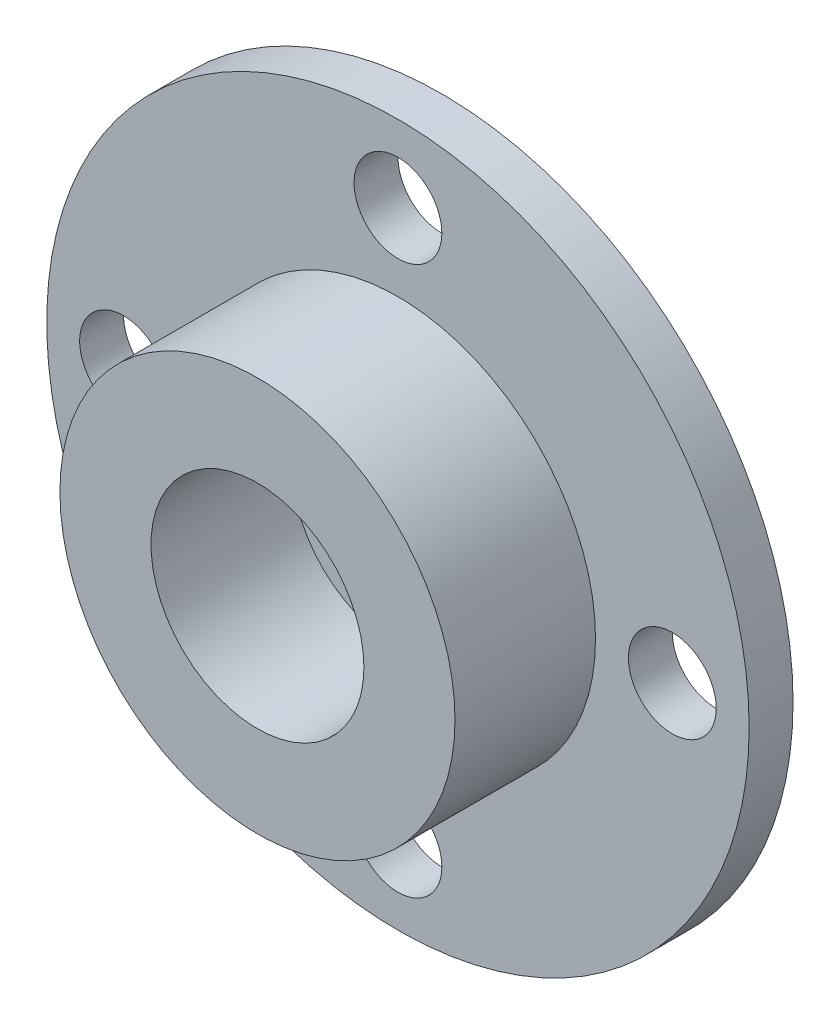
ISO-10303-21;
HEADER;
FILE_DESCRIPTION(('STEP AP214'),'2;1');
FILE_NAME('part.step','',(''),(''),'','','');
FILE_SCHEMA(('AUTOMOTIVE_DESIGN { 1 0 10303 214 1 1 1 1 }'));
ENDSEC;
DATA;
#1=APPLICATION_CONTEXT('core data for automotive mechanical design processes');
#2=APPLICATION_PROTOCOL_DEFINITION('international standard','automotive_design',2000,#1);
#3=PRODUCT_CONTEXT('',#1,'mechanical');
#4=PRODUCT('Part','Part','',(#3));
#5=PRODUCT_RELATED_PRODUCT_CATEGORY('part','',(#4));
#6=PRODUCT_DEFINITION_FORMATION('','',#4);
#7=PRODUCT_DEFINITION_CONTEXT('part definition',#1,'design');
#8=PRODUCT_DEFINITION('design','',#6,#7);
#9=PRODUCT_DEFINITION_SHAPE('','',#8);
#10=(LENGTH_UNIT() NAMED_UNIT(*) SI_UNIT(.MILLI.,.METRE.));
#11=(NAMED_UNIT(*) PLANE_ANGLE_UNIT() SI_UNIT($,.RADIAN.));
#12=(NAMED_UNIT(*) SI_UNIT($,.STERADIAN.) SOLID_ANGLE_UNIT());
#13=UNCERTAINTY_MEASURE_WITH_UNIT(LENGTH_MEASURE(1.E-05),#10,'distance_accuracy_value','');
#14=(GEOMETRIC_REPRESENTATION_CONTEXT(3) GLOBAL_UNCERTAINTY_ASSIGNED_CONTEXT((#13)) GLOBAL_UNIT_ASSIGNED_CONTEXT((#10,
#11,#12)) REPRESENTATION_CONTEXT('',''));
#15=CARTESIAN_POINT('',(0.,0.,0.));
#16=DIRECTION('',(0.,0.,1.));
#17=DIRECTION('',(1.,0.,0.));
#18=AXIS2_PLACEMENT_3D('',#15,#16,#17);
#19=CARTESIAN_POINT('',(0.,0.,-1.));
#20=DIRECTION('',(0.,0.,1.));
#21=DIRECTION('',(1.,0.,0.));
#22=AXIS2_PLACEMENT_3D('',#19,#20,#21);
#23=PLANE('',#22);
#24=CARTESIAN_POINT('',(0.,0.,-1.));
#25=DIRECTION('',(0.,0.,1.));
#26=DIRECTION('',(1.,0.,0.));
#27=AXIS2_PLACEMENT_3D('',#24,#25,#26);
#28=CIRCLE('',#27,1.);
#29=CARTESIAN_POINT('',(1.,0.,-1.));
#30=VERTEX_POINT('',#29);
#31=EDGE_CURVE('E58',#30,#30,#28,.T.);
#32=ORIENTED_EDGE('',*,*,#31,.T.);
#33=EDGE_LOOP('',(#32));
#34=FACE_BOUND('',#33,.T.);
#35=CARTESIAN_POINT('',(0.,0.,-1.));
#36=DIRECTION('',(0.,0.,-1.));
#37=DIRECTION('',(-1.,0.,0.));
#38=AXIS2_PLACEMENT_3D('',#35,#36,#37);
#39=CIRCLE('',#38,2.);
#40=CARTESIAN_POINT('',(-2.,0.,-1.));
#41=VERTEX_POINT('',#40);
#42=EDGE_CURVE('E101',#41,#41,#39,.T.);
#43=ORIENTED_EDGE('',*,*,#42,.T.);
#44=EDGE_LOOP('',(#43));
#45=FACE_BOUND('',#44,.T.);
#46=ADVANCED_FACE('F34',(#34,#45),#23,.F.);
#47=CARTESIAN_POINT('',(0.,0.,3.2));
#48=DIRECTION('',(0.,0.,-1.));
#49=DIRECTION('',(-1.,0.,0.));
#50=AXIS2_PLACEMENT_3D('',#47,#48,#49);
#51=CYLINDRICAL_SURFACE('',#50,2.425);
#52=CARTESIAN_POINT('',(0.,0.,3.2));
#53=DIRECTION('',(0.,0.,1.));
#54=DIRECTION('',(1.,0.,0.));
#55=AXIS2_PLACEMENT_3D('',#52,#53,#54);
#56=CIRCLE('',#55,2.425);
#57=CARTESIAN_POINT('',(2.425,0.,3.2));
#58=VERTEX_POINT('',#57);
#59=EDGE_CURVE('E45',#58,#58,#56,.T.);
#60=ORIENTED_EDGE('',*,*,#59,.T.);
#61=EDGE_LOOP('',(#60));
#62=FACE_BOUND('',#61,.T.);
#63=CARTESIAN_POINT('',(0.,0.,0.));
#64=DIRECTION('',(0.,0.,1.));
#65=DIRECTION('',(1.,0.,0.));
#66=AXIS2_PLACEMENT_3D('',#63,#64,#65);
#67=CIRCLE('',#66,2.425);
#68=CARTESIAN_POINT('',(2.425,0.,0.));
#69=VERTEX_POINT('',#68);
#70=EDGE_CURVE('E50',#69,#69,#67,.T.);
#71=ORIENTED_EDGE('',*,*,#70,.F.);
#72=EDGE_LOOP('',(#71));
#73=FACE_BOUND('',#72,.T.);
#74=ADVANCED_FACE('F36',(#62,#73),#51,.F.);
#75=CARTESIAN_POINT('',(0.,0.,3.2));
#76=DIRECTION('',(0.,0.,-1.));
#77=DIRECTION('',(-1.,0.,0.));
#78=AXIS2_PLACEMENT_3D('',#75,#76,#77);
#79=CYLINDRICAL_SURFACE('',#78,4.5);
#80=CARTESIAN_POINT('',(0.,0.,3.2));
#81=DIRECTION('',(0.,0.,1.));
#82=DIRECTION('',(1.,0.,0.));
#83=AXIS2_PLACEMENT_3D('',#80,#81,#82);
#84=CIRCLE('',#83,4.5);
#85=CARTESIAN_POINT('',(4.5,0.,3.2));
#86=VERTEX_POINT('',#85);
#87=EDGE_CURVE('E41',#86,#86,#84,.T.);
#88=ORIENTED_EDGE('',*,*,#87,.F.);
#89=EDGE_LOOP('',(#88));
#90=FACE_BOUND('',#89,.T.);
#91=CARTESIAN_POINT('',(0.,0.,0.));
#92=DIRECTION('',(0.,0.,1.));
#93=DIRECTION('',(1.,0.,0.));
#94=AXIS2_PLACEMENT_3D('',#91,#92,#93);
#95=CIRCLE('',#94,4.5);
#96=CARTESIAN_POINT('',(4.5,0.,0.));
#97=VERTEX_POINT('',#96);
#98=EDGE_CURVE('E54',#97,#97,#95,.T.);
#99=ORIENTED_EDGE('',*,*,#98,.T.);
#100=EDGE_LOOP('',(#99));
#101=FACE_BOUND('',#100,.T.);
#102=ADVANCED_FACE('F133',(#90,#101),#79,.T.);
#103=CARTESIAN_POINT('',(0.,0.,3.2));
#104=DIRECTION('',(0.,0.,1.));
#105=DIRECTION('',(1.,0.,0.));
#106=AXIS2_PLACEMENT_3D('',#103,#104,#105);
#107=PLANE('',#106);
#108=ORIENTED_EDGE('',*,*,#59,.F.);
#109=EDGE_LOOP('',(#108));
#110=FACE_BOUND('',#109,.T.);
#111=ORIENTED_EDGE('',*,*,#87,.T.);
#112=EDGE_LOOP('',(#111));
#113=FACE_BOUND('',#112,.T.);
#114=ADVANCED_FACE('F170',(#110,#113),#107,.T.);
#115=CARTESIAN_POINT('',(0.,0.,0.));
#116=DIRECTION('',(0.,0.,1.));
#117=DIRECTION('',(1.,0.,0.));
#118=AXIS2_PLACEMENT_3D('',#115,#116,#117);
#119=PLANE('',#118);
#120=CARTESIAN_POINT('',(0.,0.,0.));
#121=DIRECTION('',(0.,0.,1.));
#122=DIRECTION('',(1.,0.,0.));
#123=AXIS2_PLACEMENT_3D('',#120,#121,#122);
#124=CIRCLE('',#123,1.);
#125=CARTESIAN_POINT('',(1.,0.,0.));
#126=VERTEX_POINT('',#125);
#127=EDGE_CURVE('E65',#126,#126,#124,.T.);
#128=ORIENTED_EDGE('',*,*,#127,.F.);
#129=EDGE_LOOP('',(#128));
#130=FACE_BOUND('',#129,.T.);
#131=ORIENTED_EDGE('',*,*,#70,.T.);
#132=EDGE_LOOP('',(#131));
#133=FACE_BOUND('',#132,.T.);
#134=ADVANCED_FACE('F125',(#130,#133),#119,.T.);
#135=CARTESIAN_POINT('',(0.,-6.25,-1.));
#136=DIRECTION('',(0.,0.,1.));
#137=DIRECTION('',(1.,0.,0.));
#138=AXIS2_PLACEMENT_3D('',#135,#136,#137);
#139=CYLINDRICAL_SURFACE('',#138,1.);
#140=CARTESIAN_POINT('',(0.,-6.25,-1.));
#141=DIRECTION('',(0.,0.,1.));
#142=DIRECTION('',(1.,0.,0.));
#143=AXIS2_PLACEMENT_3D('',#140,#141,#142);
#144=CIRCLE('',#143,1.);
#145=CARTESIAN_POINT('',(0.999999999999978,-6.25,-1.));
#146=VERTEX_POINT('',#145);
#147=EDGE_CURVE('E62',#146,#146,#144,.T.);
#148=ORIENTED_EDGE('',*,*,#147,.F.);
#149=EDGE_LOOP('',(#148));
#150=FACE_BOUND('',#149,.T.);
#151=CARTESIAN_POINT('',(0.,-6.25,0.));
#152=DIRECTION('',(0.,0.,1.));
#153=DIRECTION('',(1.,0.,0.));
#154=AXIS2_PLACEMENT_3D('',#151,#152,#153);
#155=CIRCLE('',#154,1.);
#156=CARTESIAN_POINT('',(0.999999999999978,-6.25,0.));
#157=VERTEX_POINT('',#156);
#158=EDGE_CURVE('E69',#157,#157,#155,.T.);
#159=ORIENTED_EDGE('',*,*,#158,.T.);
#160=EDGE_LOOP('',(#159));
#161=FACE_BOUND('',#160,.T.);
#162=ADVANCED_FACE('F156',(#150,#161),#139,.F.);
#163=CARTESIAN_POINT('',(-6.25,0.,-1.));
#164=DIRECTION('',(0.,0.,1.));
#165=DIRECTION('',(1.,0.,0.));
#166=AXIS2_PLACEMENT_3D('',#163,#164,#165);
#167=CYLINDRICAL_SURFACE('',#166,0.999999999999999);
#168=CARTESIAN_POINT('',(-6.25,0.,-1.));
#169=DIRECTION('',(0.,0.,1.));
#170=DIRECTION('',(1.,0.,0.));
#171=AXIS2_PLACEMENT_3D('',#168,#169,#170);
#172=CIRCLE('',#171,0.999999999999999);
#173=CARTESIAN_POINT('',(-5.25,0.,-1.));
#174=VERTEX_POINT('',#173);
#175=EDGE_CURVE('E87',#174,#174,#172,.T.);
#176=ORIENTED_EDGE('',*,*,#175,.F.);
#177=EDGE_LOOP('',(#176));
#178=FACE_BOUND('',#177,.T.);
#179=CARTESIAN_POINT('',(-6.25,0.,0.));
#180=DIRECTION('',(0.,0.,1.));
#181=DIRECTION('',(1.,0.,0.));
#182=AXIS2_PLACEMENT_3D('',#179,#180,#181);
#183=CIRCLE('',#182,0.999999999999999);
#184=CARTESIAN_POINT('',(-5.25,0.,0.));
#185=VERTEX_POINT('',#184);
#186=EDGE_CURVE('E72',#185,#185,#183,.T.);
#187=ORIENTED_EDGE('',*,*,#186,.T.);
#188=EDGE_LOOP('',(#187));
#189=FACE_BOUND('',#188,.T.);
#190=ADVANCED_FACE('F159',(#178,#189),#167,.F.);
#191=CARTESIAN_POINT('',(0.,6.25,-1.));
#192=DIRECTION('',(0.,0.,1.));
#193=DIRECTION('',(1.,0.,0.));
#194=AXIS2_PLACEMENT_3D('',#191,#192,#193);
#195=CYLINDRICAL_SURFACE('',#194,1.);
#196=CARTESIAN_POINT('',(0.,6.25,-1.));
#197=DIRECTION('',(0.,0.,1.));
#198=DIRECTION('',(1.,0.,0.));
#199=AXIS2_PLACEMENT_3D('',#196,#197,#198);
#200=CIRCLE('',#199,1.);
#201=CARTESIAN_POINT('',(1.00000000000007,6.25,-1.));
#202=VERTEX_POINT('',#201);
#203=EDGE_CURVE('E90',#202,#202,#200,.T.);
#204=ORIENTED_EDGE('',*,*,#203,.F.);
#205=EDGE_LOOP('',(#204));
#206=FACE_BOUND('',#205,.T.);
#207=CARTESIAN_POINT('',(0.,6.25,0.));
#208=DIRECTION('',(0.,0.,1.));
#209=DIRECTION('',(1.,0.,0.));
#210=AXIS2_PLACEMENT_3D('',#207,#208,#209);
#211=CIRCLE('',#210,1.);
#212=CARTESIAN_POINT('',(1.00000000000007,6.25,0.));
#213=VERTEX_POINT('',#212);
#214=EDGE_CURVE('E75',#213,#213,#211,.T.);
#215=ORIENTED_EDGE('',*,*,#214,.T.);
#216=EDGE_LOOP('',(#215));
#217=FACE_BOUND('',#216,.T.);
#218=ADVANCED_FACE('F167',(#206,#217),#195,.F.);
#219=CARTESIAN_POINT('',(0.,0.,-1.));
#220=DIRECTION('',(0.,0.,1.));
#221=DIRECTION('',(1.,0.,0.));
#222=AXIS2_PLACEMENT_3D('',#219,#220,#221);
#223=CYLINDRICAL_SURFACE('',#222,8.);
#224=CARTESIAN_POINT('',(0.,0.,-1.));
#225=DIRECTION('',(0.,0.,1.));
#226=DIRECTION('',(1.,0.,0.));
#227=AXIS2_PLACEMENT_3D('',#224,#225,#226);
#228=CIRCLE('',#227,8.);
#229=CARTESIAN_POINT('',(8.,0.,-1.));
#230=VERTEX_POINT('',#229);
#231=EDGE_CURVE('E93',#230,#230,#228,.T.);
#232=ORIENTED_EDGE('',*,*,#231,.T.);
#233=EDGE_LOOP('',(#232));
#234=FACE_BOUND('',#233,.T.);
#235=CARTESIAN_POINT('',(0.,0.,0.));
#236=DIRECTION('',(0.,0.,1.));
#237=DIRECTION('',(1.,0.,0.));
#238=AXIS2_PLACEMENT_3D('',#235,#236,#237);
#239=CIRCLE('',#238,8.);
#240=CARTESIAN_POINT('',(8.,0.,0.));
#241=VERTEX_POINT('',#240);
#242=EDGE_CURVE('E78',#241,#241,#239,.T.);
#243=ORIENTED_EDGE('',*,*,#242,.F.);
#244=EDGE_LOOP('',(#243));
#245=FACE_BOUND('',#244,.T.);
#246=ADVANCED_FACE('F175',(#234,#245),#223,.T.);
#247=CARTESIAN_POINT('',(6.25,0.,-1.));
#248=DIRECTION('',(0.,0.,1.));
#249=DIRECTION('',(1.,0.,0.));
#250=AXIS2_PLACEMENT_3D('',#247,#248,#249);
#251=CYLINDRICAL_SURFACE('',#250,1.);
#252=CARTESIAN_POINT('',(6.25,0.,-1.));
#253=DIRECTION('',(0.,0.,1.));
#254=DIRECTION('',(1.,0.,0.));
#255=AXIS2_PLACEMENT_3D('',#252,#253,#254);
#256=CIRCLE('',#255,1.);
#257=CARTESIAN_POINT('',(7.25,0.,-1.));
#258=VERTEX_POINT('',#257);
#259=EDGE_CURVE('E68',#258,#258,#256,.T.);
#260=ORIENTED_EDGE('',*,*,#259,.F.);
#261=EDGE_LOOP('',(#260));
#262=FACE_BOUND('',#261,.T.);
#263=CARTESIAN_POINT('',(6.25,0.,0.));
#264=DIRECTION('',(0.,0.,1.));
#265=DIRECTION('',(1.,0.,0.));
#266=AXIS2_PLACEMENT_3D('',#263,#264,#265);
#267=CIRCLE('',#266,1.);
#268=CARTESIAN_POINT('',(7.25,0.,0.));
#269=VERTEX_POINT('',#268);
#270=EDGE_CURVE('E81',#269,#269,#267,.T.);
#271=ORIENTED_EDGE('',*,*,#270,.T.);
#272=EDGE_LOOP('',(#271));
#273=FACE_BOUND('',#272,.T.);
#274=ADVANCED_FACE('F142',(#262,#273),#251,.F.);
#275=CARTESIAN_POINT('',(0.,0.,-1.));
#276=DIRECTION('',(0.,0.,1.));
#277=DIRECTION('',(1.,0.,0.));
#278=AXIS2_PLACEMENT_3D('',#275,#276,#277);
#279=CYLINDRICAL_SURFACE('',#278,1.);
#280=ORIENTED_EDGE('',*,*,#31,.F.);
#281=EDGE_LOOP('',(#280));
#282=FACE_BOUND('',#281,.T.);
#283=ORIENTED_EDGE('',*,*,#127,.T.);
#284=EDGE_LOOP('',(#283));
#285=FACE_BOUND('',#284,.T.);
#286=ADVANCED_FACE('F137',(#282,#285),#279,.F.);
#287=CARTESIAN_POINT('',(0.,0.,-1.));
#288=DIRECTION('',(0.,0.,1.));
#289=DIRECTION('',(1.,0.,0.));
#290=AXIS2_PLACEMENT_3D('',#287,#288,#289);
#291=CIRCLE('',#290,3.);
#292=CARTESIAN_POINT('',(3.,0.,-1.));
#293=VERTEX_POINT('',#292);
#294=EDGE_CURVE('E10',#293,#293,#291,.F.);
#295=ORIENTED_EDGE('',*,*,#294,.F.);
#296=EDGE_LOOP('',(#295));
#297=FACE_BOUND('',#296,.T.);
#298=ORIENTED_EDGE('',*,*,#259,.T.);
#299=EDGE_LOOP('',(#298));
#300=FACE_BOUND('',#299,.T.);
#301=ORIENTED_EDGE('',*,*,#231,.F.);
#302=EDGE_LOOP('',(#301));
#303=FACE_BOUND('',#302,.T.);
#304=ORIENTED_EDGE('',*,*,#203,.T.);
#305=EDGE_LOOP('',(#304));
#306=FACE_BOUND('',#305,.T.);
#307=ORIENTED_EDGE('',*,*,#175,.T.);
#308=EDGE_LOOP('',(#307));
#309=FACE_BOUND('',#308,.T.);
#310=ORIENTED_EDGE('',*,*,#147,.T.);
#311=EDGE_LOOP('',(#310));
#312=FACE_BOUND('',#311,.T.);
#313=ADVANCED_FACE('F122',(#297,#300,#303,#306,#309,#312),#23,.F.);
#314=ORIENTED_EDGE('',*,*,#98,.F.);
#315=EDGE_LOOP('',(#314));
#316=FACE_BOUND('',#315,.T.);
#317=ORIENTED_EDGE('',*,*,#270,.F.);
#318=EDGE_LOOP('',(#317));
#319=FACE_BOUND('',#318,.T.);
#320=ORIENTED_EDGE('',*,*,#242,.T.);
#321=EDGE_LOOP('',(#320));
#322=FACE_BOUND('',#321,.T.);
#323=ORIENTED_EDGE('',*,*,#214,.F.);
#324=EDGE_LOOP('',(#323));
#325=FACE_BOUND('',#324,.T.);
#326=ORIENTED_EDGE('',*,*,#186,.F.);
#327=EDGE_LOOP('',(#326));
#328=FACE_BOUND('',#327,.T.);
#329=ORIENTED_EDGE('',*,*,#158,.F.);
#330=EDGE_LOOP('',(#329));
#331=FACE_BOUND('',#330,.T.);
#332=ADVANCED_FACE('F113',(#316,#319,#322,#325,#328,#331),#119,.T.);
#333=CARTESIAN_POINT('',(0.,0.,-2.));
#334=DIRECTION('',(0.,0.,-1.));
#335=DIRECTION('',(-1.,0.,0.));
#336=AXIS2_PLACEMENT_3D('',#333,#334,#335);
#337=PLANE('',#336);
#338=CARTESIAN_POINT('',(0.,0.,-2.));
#339=DIRECTION('',(0.,0.,-1.));
#340=DIRECTION('',(-1.,0.,0.));
#341=AXIS2_PLACEMENT_3D('',#338,#339,#340);
#342=CIRCLE('',#341,3.);
#343=CARTESIAN_POINT('',(-3.,0.,-2.));
#344=VERTEX_POINT('',#343);
#345=EDGE_CURVE('E83',#344,#344,#342,.T.);
#346=ORIENTED_EDGE('',*,*,#345,.T.);
#347=EDGE_LOOP('',(#346));
#348=FACE_BOUND('',#347,.T.);
#349=CARTESIAN_POINT('',(0.,0.,-2.));
#350=DIRECTION('',(0.,0.,-1.));
#351=DIRECTION('',(-1.,0.,0.));
#352=AXIS2_PLACEMENT_3D('',#349,#350,#351);
#353=CIRCLE('',#352,2.);
#354=CARTESIAN_POINT('',(-2.,0.,-2.));
#355=VERTEX_POINT('',#354);
#356=EDGE_CURVE('E100',#355,#355,#353,.T.);
#357=ORIENTED_EDGE('',*,*,#356,.F.);
#358=EDGE_LOOP('',(#357));
#359=FACE_BOUND('',#358,.T.);
#360=ADVANCED_FACE('F110',(#348,#359),#337,.T.);
#361=CARTESIAN_POINT('',(0.,0.,-2.));
#362=DIRECTION('',(0.,0.,1.));
#363=DIRECTION('',(1.,0.,0.));
#364=AXIS2_PLACEMENT_3D('',#361,#362,#363);
#365=CYLINDRICAL_SURFACE('',#364,3.);
#366=ORIENTED_EDGE('',*,*,#345,.F.);
#367=EDGE_LOOP('',(#366));
#368=FACE_BOUND('',#367,.T.);
#369=ORIENTED_EDGE('',*,*,#294,.T.);
#370=EDGE_LOOP('',(#369));
#371=FACE_BOUND('',#370,.T.);
#372=ADVANCED_FACE('F112',(#368,#371),#365,.T.);
#373=CARTESIAN_POINT('',(0.,0.,-2.));
#374=DIRECTION('',(0.,0.,1.));
#375=DIRECTION('',(1.,0.,0.));
#376=AXIS2_PLACEMENT_3D('',#373,#374,#375);
#377=CYLINDRICAL_SURFACE('',#376,2.);
#378=ORIENTED_EDGE('',*,*,#356,.T.);
#379=EDGE_LOOP('',(#378));
#380=FACE_BOUND('',#379,.T.);
#381=ORIENTED_EDGE('',*,*,#42,.F.);
#382=EDGE_LOOP('',(#381));
#383=FACE_BOUND('',#382,.T.);
#384=ADVANCED_FACE('F107',(#380,#383),#377,.F.);
#385=CLOSED_SHELL('',(#46,#74,#102,#114,#134,#162,#190,#218,#246,#274,#286,#313,#332,#360,#372,#384));
#386=MANIFOLD_SOLID_BREP('B2',#385);
#387=ADVANCED_BREP_SHAPE_REPRESENTATION('',(#18,#386),#14);
#388=SHAPE_DEFINITION_REPRESENTATION(#9,#387);
ENDSEC;
END-ISO-10303-21;
